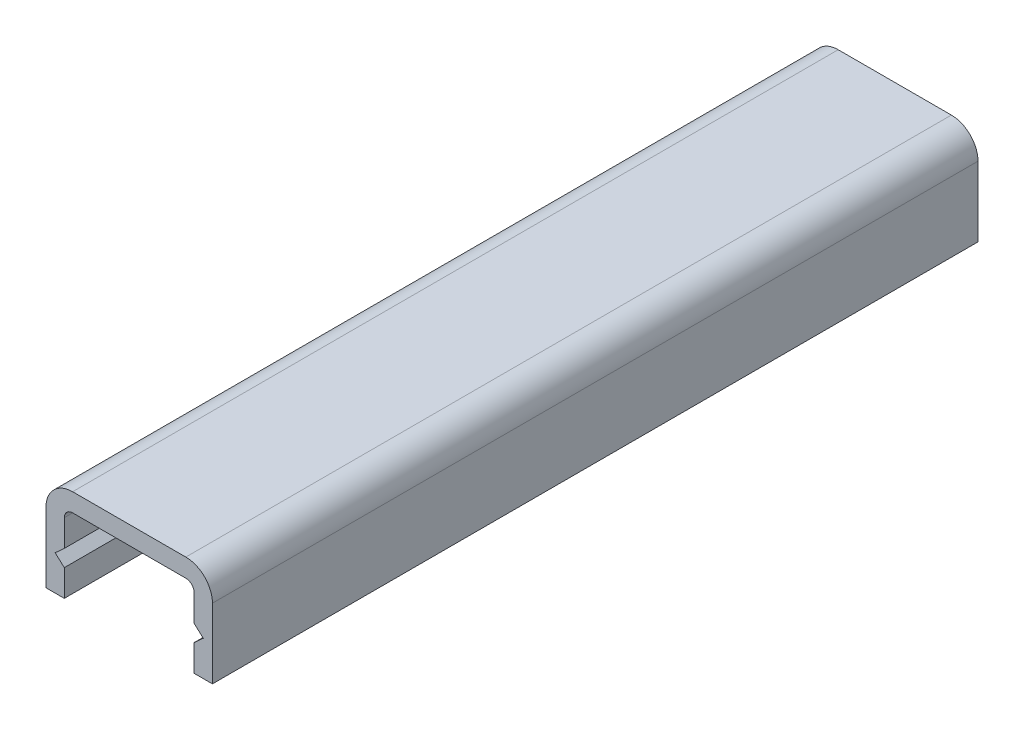
ISO-10303-21;
HEADER;
FILE_DESCRIPTION(('STEP AP214'),'2;1');
FILE_NAME('part.step','',(''),(''),'','','');
FILE_SCHEMA(('AUTOMOTIVE_DESIGN { 1 0 10303 214 1 1 1 1 }'));
ENDSEC;
DATA;
#1=APPLICATION_CONTEXT('core data for automotive mechanical design processes');
#2=APPLICATION_PROTOCOL_DEFINITION('international standard','automotive_design',2000,#1);
#3=PRODUCT_CONTEXT('',#1,'mechanical');
#4=PRODUCT('Part','Part','',(#3));
#5=PRODUCT_RELATED_PRODUCT_CATEGORY('part','',(#4));
#6=PRODUCT_DEFINITION_FORMATION('','',#4);
#7=PRODUCT_DEFINITION_CONTEXT('part definition',#1,'design');
#8=PRODUCT_DEFINITION('design','',#6,#7);
#9=PRODUCT_DEFINITION_SHAPE('','',#8);
#10=(LENGTH_UNIT() NAMED_UNIT(*) SI_UNIT(.MILLI.,.METRE.));
#11=(NAMED_UNIT(*) PLANE_ANGLE_UNIT() SI_UNIT($,.RADIAN.));
#12=(NAMED_UNIT(*) SI_UNIT($,.STERADIAN.) SOLID_ANGLE_UNIT());
#13=UNCERTAINTY_MEASURE_WITH_UNIT(LENGTH_MEASURE(1.E-05),#10,'distance_accuracy_value','');
#14=(GEOMETRIC_REPRESENTATION_CONTEXT(3) GLOBAL_UNCERTAINTY_ASSIGNED_CONTEXT((#13)) GLOBAL_UNIT_ASSIGNED_CONTEXT((#10,
#11,#12)) REPRESENTATION_CONTEXT('',''));
#15=CARTESIAN_POINT('',(0.,0.,0.));
#16=DIRECTION('',(0.,0.,1.));
#17=DIRECTION('',(1.,0.,0.));
#18=AXIS2_PLACEMENT_3D('',#15,#16,#17);
#19=CARTESIAN_POINT('',(0.,0.,46.));
#20=DIRECTION('',(0.,1.,0.));
#21=DIRECTION('',(0.,0.,1.));
#22=AXIS2_PLACEMENT_3D('',#19,#20,#21);
#23=PLANE('',#22);
#24=DIRECTION('',(1.,0.,0.));
#25=VECTOR('',#24,1.);
#26=CARTESIAN_POINT('',(0.,0.,0.));
#27=LINE('',#26,#25);
#28=CARTESIAN_POINT('',(0.,0.,0.));
#29=VERTEX_POINT('',#28);
#30=CARTESIAN_POINT('',(1.1,0.,0.));
#31=VERTEX_POINT('',#30);
#32=EDGE_CURVE('E189',#29,#31,#27,.T.);
#33=ORIENTED_EDGE('',*,*,#32,.T.);
#34=DIRECTION('',(0.,0.,-1.));
#35=VECTOR('',#34,1.);
#36=CARTESIAN_POINT('',(1.1,0.,46.));
#37=LINE('',#36,#35);
#38=CARTESIAN_POINT('',(1.1,0.,46.));
#39=VERTEX_POINT('',#38);
#40=EDGE_CURVE('E11',#39,#31,#37,.T.);
#41=ORIENTED_EDGE('',*,*,#40,.F.);
#42=DIRECTION('',(1.,0.,0.));
#43=VECTOR('',#42,1.);
#44=CARTESIAN_POINT('',(0.,0.,46.));
#45=LINE('',#44,#43);
#46=CARTESIAN_POINT('',(0.,0.,46.));
#47=VERTEX_POINT('',#46);
#48=EDGE_CURVE('E223',#47,#39,#45,.T.);
#49=ORIENTED_EDGE('',*,*,#48,.F.);
#50=DIRECTION('',(0.,0.,-1.));
#51=VECTOR('',#50,1.);
#52=CARTESIAN_POINT('',(0.,0.,46.));
#53=LINE('',#52,#51);
#54=EDGE_CURVE('E185',#47,#29,#53,.T.);
#55=ORIENTED_EDGE('',*,*,#54,.T.);
#56=EDGE_LOOP('',(#33,#41,#49,#55));
#57=FACE_BOUND('',#56,.T.);
#58=ADVANCED_FACE('F33',(#57),#23,.F.);
#59=CARTESIAN_POINT('',(1.1,1.6,46.));
#60=DIRECTION('',(-1.,0.,0.));
#61=DIRECTION('',(0.,0.,1.));
#62=AXIS2_PLACEMENT_3D('',#59,#60,#61);
#63=PLANE('',#62);
#64=DIRECTION('',(0.,1.,0.));
#65=VECTOR('',#64,1.);
#66=CARTESIAN_POINT('',(1.1,1.6,0.));
#67=LINE('',#66,#65);
#68=CARTESIAN_POINT('',(1.1,1.6,0.));
#69=VERTEX_POINT('',#68);
#70=EDGE_CURVE('E192',#31,#69,#67,.T.);
#71=ORIENTED_EDGE('',*,*,#70,.T.);
#72=DIRECTION('',(0.,0.,-1.));
#73=VECTOR('',#72,1.);
#74=CARTESIAN_POINT('',(1.1,1.6,46.));
#75=LINE('',#74,#73);
#76=CARTESIAN_POINT('',(1.1,1.6,46.));
#77=VERTEX_POINT('',#76);
#78=EDGE_CURVE('E41',#77,#69,#75,.T.);
#79=ORIENTED_EDGE('',*,*,#78,.F.);
#80=DIRECTION('',(0.,1.,0.));
#81=VECTOR('',#80,1.);
#82=CARTESIAN_POINT('',(1.1,1.6,46.));
#83=LINE('',#82,#81);
#84=EDGE_CURVE('E122',#39,#77,#83,.T.);
#85=ORIENTED_EDGE('',*,*,#84,.F.);
#86=ORIENTED_EDGE('',*,*,#40,.T.);
#87=EDGE_LOOP('',(#71,#79,#85,#86));
#88=FACE_BOUND('',#87,.T.);
#89=ADVANCED_FACE('F331',(#88),#63,.F.);
#90=CARTESIAN_POINT('',(1.1,1.6,46.));
#91=DIRECTION('',(-0.672672793996314,-0.739940073395942,0.));
#92=DIRECTION('',(0.739940073395943,-0.672672793996314,0.));
#93=AXIS2_PLACEMENT_3D('',#90,#91,#92);
#94=PLANE('',#93);
#95=DIRECTION('',(-0.739940073395943,0.672672793996314,0.));
#96=VECTOR('',#95,1.);
#97=CARTESIAN_POINT('',(1.1,1.6,0.));
#98=LINE('',#97,#96);
#99=CARTESIAN_POINT('',(0.55,2.1,0.));
#100=VERTEX_POINT('',#99);
#101=EDGE_CURVE('E194',#69,#100,#98,.T.);
#102=ORIENTED_EDGE('',*,*,#101,.T.);
#103=DIRECTION('',(0.,0.,-1.));
#104=VECTOR('',#103,1.);
#105=CARTESIAN_POINT('',(0.55,2.1,46.));
#106=LINE('',#105,#104);
#107=CARTESIAN_POINT('',(0.55,2.1,46.));
#108=VERTEX_POINT('',#107);
#109=EDGE_CURVE('E260',#108,#100,#106,.T.);
#110=ORIENTED_EDGE('',*,*,#109,.F.);
#111=DIRECTION('',(-0.739940073395943,0.672672793996314,0.));
#112=VECTOR('',#111,1.);
#113=CARTESIAN_POINT('',(1.1,1.6,46.));
#114=LINE('',#113,#112);
#115=EDGE_CURVE('E268',#77,#108,#114,.T.);
#116=ORIENTED_EDGE('',*,*,#115,.F.);
#117=ORIENTED_EDGE('',*,*,#78,.T.);
#118=EDGE_LOOP('',(#102,#110,#116,#117));
#119=FACE_BOUND('',#118,.T.);
#120=ADVANCED_FACE('F266',(#119),#94,.F.);
#121=CARTESIAN_POINT('',(1.1,2.6,46.));
#122=DIRECTION('',(-0.672672793996311,0.739940073395945,0.));
#123=DIRECTION('',(-0.739940073395945,-0.672672793996311,0.));
#124=AXIS2_PLACEMENT_3D('',#121,#122,#123);
#125=PLANE('',#124);
#126=DIRECTION('',(0.739940073395945,0.672672793996311,0.));
#127=VECTOR('',#126,1.);
#128=CARTESIAN_POINT('',(1.1,2.6,0.));
#129=LINE('',#128,#127);
#130=CARTESIAN_POINT('',(1.1,2.6,0.));
#131=VERTEX_POINT('',#130);
#132=EDGE_CURVE('E196',#100,#131,#129,.T.);
#133=ORIENTED_EDGE('',*,*,#132,.T.);
#134=DIRECTION('',(0.,0.,-1.));
#135=VECTOR('',#134,1.);
#136=CARTESIAN_POINT('',(1.1,2.6,46.));
#137=LINE('',#136,#135);
#138=CARTESIAN_POINT('',(1.1,2.6,46.));
#139=VERTEX_POINT('',#138);
#140=EDGE_CURVE('E257',#139,#131,#137,.T.);
#141=ORIENTED_EDGE('',*,*,#140,.F.);
#142=DIRECTION('',(0.739940073395945,0.672672793996311,0.));
#143=VECTOR('',#142,1.);
#144=CARTESIAN_POINT('',(1.1,2.6,46.));
#145=LINE('',#144,#143);
#146=EDGE_CURVE('E286',#108,#139,#145,.T.);
#147=ORIENTED_EDGE('',*,*,#146,.F.);
#148=ORIENTED_EDGE('',*,*,#109,.T.);
#149=EDGE_LOOP('',(#133,#141,#147,#148));
#150=FACE_BOUND('',#149,.T.);
#151=ADVANCED_FACE('F277',(#150),#125,.F.);
#152=CARTESIAN_POINT('',(1.1,4.2,46.));
#153=DIRECTION('',(-1.,0.,0.));
#154=DIRECTION('',(0.,-1.,0.));
#155=AXIS2_PLACEMENT_3D('',#152,#153,#154);
#156=PLANE('',#155);
#157=DIRECTION('',(0.,1.,0.));
#158=VECTOR('',#157,1.);
#159=CARTESIAN_POINT('',(1.1,4.2,0.));
#160=LINE('',#159,#158);
#161=CARTESIAN_POINT('',(1.1,4.2,0.));
#162=VERTEX_POINT('',#161);
#163=EDGE_CURVE('E198',#131,#162,#160,.T.);
#164=ORIENTED_EDGE('',*,*,#163,.T.);
#165=DIRECTION('',(0.,0.,-1.));
#166=VECTOR('',#165,1.);
#167=CARTESIAN_POINT('',(1.1,4.2,46.));
#168=LINE('',#167,#166);
#169=CARTESIAN_POINT('',(1.1,4.2,46.));
#170=VERTEX_POINT('',#169);
#171=EDGE_CURVE('E254',#170,#162,#168,.T.);
#172=ORIENTED_EDGE('',*,*,#171,.F.);
#173=DIRECTION('',(0.,1.,0.));
#174=VECTOR('',#173,1.);
#175=CARTESIAN_POINT('',(1.1,4.2,46.));
#176=LINE('',#175,#174);
#177=EDGE_CURVE('E283',#139,#170,#176,.T.);
#178=ORIENTED_EDGE('',*,*,#177,.F.);
#179=ORIENTED_EDGE('',*,*,#140,.T.);
#180=EDGE_LOOP('',(#164,#172,#178,#179));
#181=FACE_BOUND('',#180,.T.);
#182=ADVANCED_FACE('F281',(#181),#156,.F.);
#183=CARTESIAN_POINT('',(1.59999999999999,4.2,46.));
#184=DIRECTION('',(0.,0.,-1.));
#185=DIRECTION('',(-1.,0.,0.));
#186=AXIS2_PLACEMENT_3D('',#183,#184,#185);
#187=CYLINDRICAL_SURFACE('',#186,0.499999999999992);
#188=CARTESIAN_POINT('',(1.59999999999999,4.2,0.));
#189=DIRECTION('',(0.,0.,-1.));
#190=DIRECTION('',(1.,0.,0.));
#191=AXIS2_PLACEMENT_3D('',#188,#189,#190);
#192=CIRCLE('',#191,0.499999999999992);
#193=CARTESIAN_POINT('',(1.59999999999999,4.69999999999999,0.));
#194=VERTEX_POINT('',#193);
#195=EDGE_CURVE('E200',#162,#194,#192,.T.);
#196=ORIENTED_EDGE('',*,*,#195,.T.);
#197=DIRECTION('',(0.,0.,-1.));
#198=VECTOR('',#197,1.);
#199=CARTESIAN_POINT('',(1.59999999999999,4.69999999999999,46.));
#200=LINE('',#199,#198);
#201=CARTESIAN_POINT('',(1.59999999999999,4.69999999999999,46.));
#202=VERTEX_POINT('',#201);
#203=EDGE_CURVE('E251',#202,#194,#200,.T.);
#204=ORIENTED_EDGE('',*,*,#203,.F.);
#205=CARTESIAN_POINT('',(1.59999999999999,4.2,46.));
#206=DIRECTION('',(0.,0.,-1.));
#207=DIRECTION('',(1.,0.,0.));
#208=AXIS2_PLACEMENT_3D('',#205,#206,#207);
#209=CIRCLE('',#208,0.499999999999992);
#210=EDGE_CURVE('E285',#170,#202,#209,.T.);
#211=ORIENTED_EDGE('',*,*,#210,.F.);
#212=ORIENTED_EDGE('',*,*,#171,.T.);
#213=EDGE_LOOP('',(#196,#204,#211,#212));
#214=FACE_BOUND('',#213,.T.);
#215=ADVANCED_FACE('F344',(#214),#187,.F.);
#216=CARTESIAN_POINT('',(1.59999999999999,4.69999999999999,46.));
#217=DIRECTION('',(0.,1.,0.));
#218=DIRECTION('',(0.,0.,1.));
#219=AXIS2_PLACEMENT_3D('',#216,#217,#218);
#220=PLANE('',#219);
#221=DIRECTION('',(1.,0.,0.));
#222=VECTOR('',#221,1.);
#223=CARTESIAN_POINT('',(1.59999999999999,4.69999999999999,0.));
#224=LINE('',#223,#222);
#225=CARTESIAN_POINT('',(8.39999999999998,4.69999999999999,0.));
#226=VERTEX_POINT('',#225);
#227=EDGE_CURVE('E202',#194,#226,#224,.T.);
#228=ORIENTED_EDGE('',*,*,#227,.T.);
#229=DIRECTION('',(0.,0.,-1.));
#230=VECTOR('',#229,1.);
#231=CARTESIAN_POINT('',(8.39999999999998,4.69999999999999,46.));
#232=LINE('',#231,#230);
#233=CARTESIAN_POINT('',(8.39999999999998,4.69999999999999,46.));
#234=VERTEX_POINT('',#233);
#235=EDGE_CURVE('E248',#234,#226,#232,.T.);
#236=ORIENTED_EDGE('',*,*,#235,.F.);
#237=DIRECTION('',(1.,0.,0.));
#238=VECTOR('',#237,1.);
#239=CARTESIAN_POINT('',(1.59999999999999,4.69999999999999,46.));
#240=LINE('',#239,#238);
#241=EDGE_CURVE('E288',#202,#234,#240,.T.);
#242=ORIENTED_EDGE('',*,*,#241,.F.);
#243=ORIENTED_EDGE('',*,*,#203,.T.);
#244=EDGE_LOOP('',(#228,#236,#242,#243));
#245=FACE_BOUND('',#244,.T.);
#246=ADVANCED_FACE('F347',(#245),#220,.F.);
#247=CARTESIAN_POINT('',(8.39999999999998,4.2,46.));
#248=DIRECTION('',(0.,0.,-1.));
#249=DIRECTION('',(-1.,0.,0.));
#250=AXIS2_PLACEMENT_3D('',#247,#248,#249);
#251=CYLINDRICAL_SURFACE('',#250,0.499999999999991);
#252=CARTESIAN_POINT('',(8.39999999999998,4.2,0.));
#253=DIRECTION('',(0.,0.,-1.));
#254=DIRECTION('',(1.,0.,0.));
#255=AXIS2_PLACEMENT_3D('',#252,#253,#254);
#256=CIRCLE('',#255,0.499999999999991);
#257=CARTESIAN_POINT('',(8.89999999999997,4.2,0.));
#258=VERTEX_POINT('',#257);
#259=EDGE_CURVE('E204',#226,#258,#256,.T.);
#260=ORIENTED_EDGE('',*,*,#259,.T.);
#261=DIRECTION('',(0.,0.,-1.));
#262=VECTOR('',#261,1.);
#263=CARTESIAN_POINT('',(8.89999999999997,4.2,46.));
#264=LINE('',#263,#262);
#265=CARTESIAN_POINT('',(8.89999999999997,4.2,46.));
#266=VERTEX_POINT('',#265);
#267=EDGE_CURVE('E245',#266,#258,#264,.T.);
#268=ORIENTED_EDGE('',*,*,#267,.F.);
#269=CARTESIAN_POINT('',(8.39999999999998,4.2,46.));
#270=DIRECTION('',(0.,0.,-1.));
#271=DIRECTION('',(1.,0.,0.));
#272=AXIS2_PLACEMENT_3D('',#269,#270,#271);
#273=CIRCLE('',#272,0.499999999999991);
#274=EDGE_CURVE('E294',#234,#266,#273,.T.);
#275=ORIENTED_EDGE('',*,*,#274,.F.);
#276=ORIENTED_EDGE('',*,*,#235,.T.);
#277=EDGE_LOOP('',(#260,#268,#275,#276));
#278=FACE_BOUND('',#277,.T.);
#279=ADVANCED_FACE('F351',(#278),#251,.F.);
#280=CARTESIAN_POINT('',(8.89999999999997,4.2,46.));
#281=DIRECTION('',(1.,0.,0.));
#282=DIRECTION('',(0.,1.,0.));
#283=AXIS2_PLACEMENT_3D('',#280,#281,#282);
#284=PLANE('',#283);
#285=DIRECTION('',(0.,-1.,0.));
#286=VECTOR('',#285,1.);
#287=CARTESIAN_POINT('',(8.89999999999997,4.2,0.));
#288=LINE('',#287,#286);
#289=CARTESIAN_POINT('',(8.89999999999998,2.6,0.));
#290=VERTEX_POINT('',#289);
#291=EDGE_CURVE('E206',#258,#290,#288,.T.);
#292=ORIENTED_EDGE('',*,*,#291,.T.);
#293=DIRECTION('',(0.,0.,-1.));
#294=VECTOR('',#293,1.);
#295=CARTESIAN_POINT('',(8.89999999999998,2.6,46.));
#296=LINE('',#295,#294);
#297=CARTESIAN_POINT('',(8.89999999999998,2.6,46.));
#298=VERTEX_POINT('',#297);
#299=EDGE_CURVE('E242',#298,#290,#296,.T.);
#300=ORIENTED_EDGE('',*,*,#299,.F.);
#301=DIRECTION('',(0.,-1.,0.));
#302=VECTOR('',#301,1.);
#303=CARTESIAN_POINT('',(8.89999999999997,4.2,46.));
#304=LINE('',#303,#302);
#305=EDGE_CURVE('E296',#266,#298,#304,.T.);
#306=ORIENTED_EDGE('',*,*,#305,.F.);
#307=ORIENTED_EDGE('',*,*,#267,.T.);
#308=EDGE_LOOP('',(#292,#300,#306,#307));
#309=FACE_BOUND('',#308,.T.);
#310=ADVANCED_FACE('F355',(#309),#284,.F.);
#311=CARTESIAN_POINT('',(8.89999999999998,2.6,46.));
#312=DIRECTION('',(0.672672793996294,0.739940073395961,0.));
#313=DIRECTION('',(-0.739940073395961,0.672672793996294,0.));
#314=AXIS2_PLACEMENT_3D('',#311,#312,#313);
#315=PLANE('',#314);
#316=DIRECTION('',(0.739940073395961,-0.672672793996294,0.));
#317=VECTOR('',#316,1.);
#318=CARTESIAN_POINT('',(8.89999999999998,2.6,0.));
#319=LINE('',#318,#317);
#320=CARTESIAN_POINT('',(9.45,2.1,0.));
#321=VERTEX_POINT('',#320);
#322=EDGE_CURVE('E208',#290,#321,#319,.T.);
#323=ORIENTED_EDGE('',*,*,#322,.T.);
#324=DIRECTION('',(0.,0.,-1.));
#325=VECTOR('',#324,1.);
#326=CARTESIAN_POINT('',(9.45,2.1,46.));
#327=LINE('',#326,#325);
#328=CARTESIAN_POINT('',(9.45,2.1,46.));
#329=VERTEX_POINT('',#328);
#330=EDGE_CURVE('E239',#329,#321,#327,.T.);
#331=ORIENTED_EDGE('',*,*,#330,.F.);
#332=DIRECTION('',(0.739940073395961,-0.672672793996294,0.));
#333=VECTOR('',#332,1.);
#334=CARTESIAN_POINT('',(8.89999999999998,2.6,46.));
#335=LINE('',#334,#333);
#336=EDGE_CURVE('E298',#298,#329,#335,.T.);
#337=ORIENTED_EDGE('',*,*,#336,.F.);
#338=ORIENTED_EDGE('',*,*,#299,.T.);
#339=EDGE_LOOP('',(#323,#331,#337,#338));
#340=FACE_BOUND('',#339,.T.);
#341=ADVANCED_FACE('F359',(#340),#315,.F.);
#342=CARTESIAN_POINT('',(8.89999999999998,1.6,46.));
#343=DIRECTION('',(0.672672793996296,-0.739940073395959,0.));
#344=DIRECTION('',(0.739940073395959,0.672672793996296,0.));
#345=AXIS2_PLACEMENT_3D('',#342,#343,#344);
#346=PLANE('',#345);
#347=DIRECTION('',(-0.739940073395959,-0.672672793996296,0.));
#348=VECTOR('',#347,1.);
#349=CARTESIAN_POINT('',(8.89999999999998,1.6,0.));
#350=LINE('',#349,#348);
#351=CARTESIAN_POINT('',(8.89999999999998,1.6,0.));
#352=VERTEX_POINT('',#351);
#353=EDGE_CURVE('E210',#321,#352,#350,.T.);
#354=ORIENTED_EDGE('',*,*,#353,.T.);
#355=DIRECTION('',(0.,0.,-1.));
#356=VECTOR('',#355,1.);
#357=CARTESIAN_POINT('',(8.89999999999998,1.6,46.));
#358=LINE('',#357,#356);
#359=CARTESIAN_POINT('',(8.89999999999998,1.6,46.));
#360=VERTEX_POINT('',#359);
#361=EDGE_CURVE('E236',#360,#352,#358,.T.);
#362=ORIENTED_EDGE('',*,*,#361,.F.);
#363=DIRECTION('',(-0.739940073395959,-0.672672793996296,0.));
#364=VECTOR('',#363,1.);
#365=CARTESIAN_POINT('',(8.89999999999998,1.6,46.));
#366=LINE('',#365,#364);
#367=EDGE_CURVE('E300',#329,#360,#366,.T.);
#368=ORIENTED_EDGE('',*,*,#367,.F.);
#369=ORIENTED_EDGE('',*,*,#330,.T.);
#370=EDGE_LOOP('',(#354,#362,#368,#369));
#371=FACE_BOUND('',#370,.T.);
#372=ADVANCED_FACE('F363',(#371),#346,.F.);
#373=CARTESIAN_POINT('',(8.89999999999998,1.6,46.));
#374=DIRECTION('',(1.,0.,0.));
#375=DIRECTION('',(0.,0.,-1.));
#376=AXIS2_PLACEMENT_3D('',#373,#374,#375);
#377=PLANE('',#376);
#378=DIRECTION('',(0.,-1.,0.));
#379=VECTOR('',#378,1.);
#380=CARTESIAN_POINT('',(8.89999999999998,1.6,0.));
#381=LINE('',#380,#379);
#382=CARTESIAN_POINT('',(8.89999999999998,0.,0.));
#383=VERTEX_POINT('',#382);
#384=EDGE_CURVE('E212',#352,#383,#381,.T.);
#385=ORIENTED_EDGE('',*,*,#384,.T.);
#386=DIRECTION('',(0.,0.,-1.));
#387=VECTOR('',#386,1.);
#388=CARTESIAN_POINT('',(8.89999999999998,0.,46.));
#389=LINE('',#388,#387);
#390=CARTESIAN_POINT('',(8.89999999999998,0.,46.));
#391=VERTEX_POINT('',#390);
#392=EDGE_CURVE('E233',#391,#383,#389,.T.);
#393=ORIENTED_EDGE('',*,*,#392,.F.);
#394=DIRECTION('',(0.,-1.,0.));
#395=VECTOR('',#394,1.);
#396=CARTESIAN_POINT('',(8.89999999999998,1.6,46.));
#397=LINE('',#396,#395);
#398=EDGE_CURVE('E302',#360,#391,#397,.T.);
#399=ORIENTED_EDGE('',*,*,#398,.F.);
#400=ORIENTED_EDGE('',*,*,#361,.T.);
#401=EDGE_LOOP('',(#385,#393,#399,#400));
#402=FACE_BOUND('',#401,.T.);
#403=ADVANCED_FACE('F367',(#402),#377,.F.);
#404=CARTESIAN_POINT('',(9.99999999999998,0.,46.));
#405=DIRECTION('',(0.,1.,0.));
#406=DIRECTION('',(0.,0.,1.));
#407=AXIS2_PLACEMENT_3D('',#404,#405,#406);
#408=PLANE('',#407);
#409=DIRECTION('',(1.,0.,0.));
#410=VECTOR('',#409,1.);
#411=CARTESIAN_POINT('',(9.99999999999998,0.,0.));
#412=LINE('',#411,#410);
#413=CARTESIAN_POINT('',(9.99999999999998,0.,0.));
#414=VERTEX_POINT('',#413);
#415=EDGE_CURVE('E214',#383,#414,#412,.T.);
#416=ORIENTED_EDGE('',*,*,#415,.T.);
#417=DIRECTION('',(0.,0.,-1.));
#418=VECTOR('',#417,1.);
#419=CARTESIAN_POINT('',(9.99999999999998,0.,46.));
#420=LINE('',#419,#418);
#421=CARTESIAN_POINT('',(9.99999999999998,0.,46.));
#422=VERTEX_POINT('',#421);
#423=EDGE_CURVE('E230',#422,#414,#420,.T.);
#424=ORIENTED_EDGE('',*,*,#423,.F.);
#425=DIRECTION('',(1.,0.,0.));
#426=VECTOR('',#425,1.);
#427=CARTESIAN_POINT('',(9.99999999999998,0.,46.));
#428=LINE('',#427,#426);
#429=EDGE_CURVE('E304',#391,#422,#428,.T.);
#430=ORIENTED_EDGE('',*,*,#429,.F.);
#431=ORIENTED_EDGE('',*,*,#392,.T.);
#432=EDGE_LOOP('',(#416,#424,#430,#431));
#433=FACE_BOUND('',#432,.T.);
#434=ADVANCED_FACE('F371',(#433),#408,.F.);
#435=CARTESIAN_POINT('',(9.99999999999998,4.19999999999999,46.));
#436=DIRECTION('',(-1.,0.,0.));
#437=DIRECTION('',(0.,0.,1.));
#438=AXIS2_PLACEMENT_3D('',#435,#436,#437);
#439=PLANE('',#438);
#440=DIRECTION('',(0.,1.,0.));
#441=VECTOR('',#440,1.);
#442=CARTESIAN_POINT('',(9.99999999999998,4.19999999999999,0.));
#443=LINE('',#442,#441);
#444=CARTESIAN_POINT('',(9.99999999999998,4.19999999999999,0.));
#445=VERTEX_POINT('',#444);
#446=EDGE_CURVE('E216',#414,#445,#443,.T.);
#447=ORIENTED_EDGE('',*,*,#446,.T.);
#448=DIRECTION('',(0.,0.,-1.));
#449=VECTOR('',#448,1.);
#450=CARTESIAN_POINT('',(9.99999999999998,4.19999999999999,46.));
#451=LINE('',#450,#449);
#452=CARTESIAN_POINT('',(9.99999999999998,4.19999999999999,46.));
#453=VERTEX_POINT('',#452);
#454=EDGE_CURVE('E227',#453,#445,#451,.T.);
#455=ORIENTED_EDGE('',*,*,#454,.F.);
#456=DIRECTION('',(0.,1.,0.));
#457=VECTOR('',#456,1.);
#458=CARTESIAN_POINT('',(9.99999999999998,4.19999999999999,46.));
#459=LINE('',#458,#457);
#460=EDGE_CURVE('E306',#422,#453,#459,.T.);
#461=ORIENTED_EDGE('',*,*,#460,.F.);
#462=ORIENTED_EDGE('',*,*,#423,.T.);
#463=EDGE_LOOP('',(#447,#455,#461,#462));
#464=FACE_BOUND('',#463,.T.);
#465=ADVANCED_FACE('F312',(#464),#439,.F.);
#466=CARTESIAN_POINT('',(8.39999999999998,4.19999999999999,46.));
#467=DIRECTION('',(0.,0.,-1.));
#468=DIRECTION('',(-1.,0.,0.));
#469=AXIS2_PLACEMENT_3D('',#466,#467,#468);
#470=CYLINDRICAL_SURFACE('',#469,1.6);
#471=CARTESIAN_POINT('',(8.39999999999998,4.19999999999999,0.));
#472=DIRECTION('',(0.,0.,1.));
#473=DIRECTION('',(-1.,0.,0.));
#474=AXIS2_PLACEMENT_3D('',#471,#472,#473);
#475=CIRCLE('',#474,1.6);
#476=CARTESIAN_POINT('',(8.39999999999998,5.79999999999999,0.));
#477=VERTEX_POINT('',#476);
#478=EDGE_CURVE('E218',#445,#477,#475,.T.);
#479=ORIENTED_EDGE('',*,*,#478,.T.);
#480=DIRECTION('',(0.,0.,-1.));
#481=VECTOR('',#480,1.);
#482=CARTESIAN_POINT('',(8.39999999999998,5.79999999999999,46.));
#483=LINE('',#482,#481);
#484=CARTESIAN_POINT('',(8.39999999999998,5.79999999999999,46.));
#485=VERTEX_POINT('',#484);
#486=EDGE_CURVE('E180',#485,#477,#483,.T.);
#487=ORIENTED_EDGE('',*,*,#486,.F.);
#488=CARTESIAN_POINT('',(8.39999999999998,4.19999999999999,46.));
#489=DIRECTION('',(0.,0.,1.));
#490=DIRECTION('',(-1.,0.,0.));
#491=AXIS2_PLACEMENT_3D('',#488,#489,#490);
#492=CIRCLE('',#491,1.6);
#493=EDGE_CURVE('E171',#453,#485,#492,.T.);
#494=ORIENTED_EDGE('',*,*,#493,.F.);
#495=ORIENTED_EDGE('',*,*,#454,.T.);
#496=EDGE_LOOP('',(#479,#487,#494,#495));
#497=FACE_BOUND('',#496,.T.);
#498=ADVANCED_FACE('F316',(#497),#470,.T.);
#499=CARTESIAN_POINT('',(1.6,5.79999999999999,46.));
#500=DIRECTION('',(0.,-1.,0.));
#501=DIRECTION('',(0.,0.,-1.));
#502=AXIS2_PLACEMENT_3D('',#499,#500,#501);
#503=PLANE('',#502);
#504=DIRECTION('',(-1.,0.,0.));
#505=VECTOR('',#504,1.);
#506=CARTESIAN_POINT('',(1.6,5.79999999999999,0.));
#507=LINE('',#506,#505);
#508=CARTESIAN_POINT('',(1.6,5.79999999999999,0.));
#509=VERTEX_POINT('',#508);
#510=EDGE_CURVE('E179',#477,#509,#507,.T.);
#511=ORIENTED_EDGE('',*,*,#510,.T.);
#512=DIRECTION('',(0.,0.,-1.));
#513=VECTOR('',#512,1.);
#514=CARTESIAN_POINT('',(1.6,5.79999999999999,46.));
#515=LINE('',#514,#513);
#516=CARTESIAN_POINT('',(1.6,5.79999999999999,46.));
#517=VERTEX_POINT('',#516);
#518=EDGE_CURVE('E176',#517,#509,#515,.T.);
#519=ORIENTED_EDGE('',*,*,#518,.F.);
#520=DIRECTION('',(-1.,0.,0.));
#521=VECTOR('',#520,1.);
#522=CARTESIAN_POINT('',(1.6,5.79999999999999,46.));
#523=LINE('',#522,#521);
#524=EDGE_CURVE('E165',#485,#517,#523,.T.);
#525=ORIENTED_EDGE('',*,*,#524,.F.);
#526=ORIENTED_EDGE('',*,*,#486,.T.);
#527=EDGE_LOOP('',(#511,#519,#525,#526));
#528=FACE_BOUND('',#527,.T.);
#529=ADVANCED_FACE('F177',(#528),#503,.F.);
#530=CARTESIAN_POINT('',(1.6,4.19999999999999,46.));
#531=DIRECTION('',(0.,0.,-1.));
#532=DIRECTION('',(-1.,0.,0.));
#533=AXIS2_PLACEMENT_3D('',#530,#531,#532);
#534=CYLINDRICAL_SURFACE('',#533,1.6);
#535=CARTESIAN_POINT('',(1.6,4.19999999999999,0.));
#536=DIRECTION('',(0.,0.,1.));
#537=DIRECTION('',(-1.,0.,0.));
#538=AXIS2_PLACEMENT_3D('',#535,#536,#537);
#539=CIRCLE('',#538,1.6);
#540=CARTESIAN_POINT('',(0.,4.19999999999999,0.));
#541=VERTEX_POINT('',#540);
#542=EDGE_CURVE('E108',#509,#541,#539,.T.);
#543=ORIENTED_EDGE('',*,*,#542,.T.);
#544=DIRECTION('',(0.,0.,-1.));
#545=VECTOR('',#544,1.);
#546=CARTESIAN_POINT('',(0.,4.19999999999999,46.));
#547=LINE('',#546,#545);
#548=CARTESIAN_POINT('',(0.,4.19999999999999,46.));
#549=VERTEX_POINT('',#548);
#550=EDGE_CURVE('E181',#549,#541,#547,.T.);
#551=ORIENTED_EDGE('',*,*,#550,.F.);
#552=CARTESIAN_POINT('',(1.6,4.19999999999999,46.));
#553=DIRECTION('',(0.,0.,1.));
#554=DIRECTION('',(-1.,0.,0.));
#555=AXIS2_PLACEMENT_3D('',#552,#553,#554);
#556=CIRCLE('',#555,1.6);
#557=EDGE_CURVE('E169',#517,#549,#556,.T.);
#558=ORIENTED_EDGE('',*,*,#557,.F.);
#559=ORIENTED_EDGE('',*,*,#518,.T.);
#560=EDGE_LOOP('',(#543,#551,#558,#559));
#561=FACE_BOUND('',#560,.T.);
#562=ADVANCED_FACE('F183',(#561),#534,.T.);
#563=CARTESIAN_POINT('',(0.,4.19999999999999,46.));
#564=DIRECTION('',(1.,0.,0.));
#565=DIRECTION('',(0.,1.,0.));
#566=AXIS2_PLACEMENT_3D('',#563,#564,#565);
#567=PLANE('',#566);
#568=DIRECTION('',(0.,-1.,0.));
#569=VECTOR('',#568,1.);
#570=CARTESIAN_POINT('',(0.,4.19999999999999,0.));
#571=LINE('',#570,#569);
#572=EDGE_CURVE('E114',#541,#29,#571,.T.);
#573=ORIENTED_EDGE('',*,*,#572,.T.);
#574=ORIENTED_EDGE('',*,*,#54,.F.);
#575=DIRECTION('',(0.,-1.,0.));
#576=VECTOR('',#575,1.);
#577=CARTESIAN_POINT('',(0.,4.19999999999999,46.));
#578=LINE('',#577,#576);
#579=EDGE_CURVE('E49',#549,#47,#578,.T.);
#580=ORIENTED_EDGE('',*,*,#579,.F.);
#581=ORIENTED_EDGE('',*,*,#550,.T.);
#582=EDGE_LOOP('',(#573,#574,#580,#581));
#583=FACE_BOUND('',#582,.T.);
#584=ADVANCED_FACE('F320',(#583),#567,.F.);
#585=CARTESIAN_POINT('',(1.59999999999999,4.2,46.));
#586=DIRECTION('',(0.,0.,1.));
#587=DIRECTION('',(1.,0.,0.));
#588=AXIS2_PLACEMENT_3D('',#585,#586,#587);
#589=PLANE('',#588);
#590=ORIENTED_EDGE('',*,*,#48,.T.);
#591=ORIENTED_EDGE('',*,*,#84,.T.);
#592=ORIENTED_EDGE('',*,*,#115,.T.);
#593=ORIENTED_EDGE('',*,*,#146,.T.);
#594=ORIENTED_EDGE('',*,*,#177,.T.);
#595=ORIENTED_EDGE('',*,*,#210,.T.);
#596=ORIENTED_EDGE('',*,*,#241,.T.);
#597=ORIENTED_EDGE('',*,*,#274,.T.);
#598=ORIENTED_EDGE('',*,*,#305,.T.);
#599=ORIENTED_EDGE('',*,*,#336,.T.);
#600=ORIENTED_EDGE('',*,*,#367,.T.);
#601=ORIENTED_EDGE('',*,*,#398,.T.);
#602=ORIENTED_EDGE('',*,*,#429,.T.);
#603=ORIENTED_EDGE('',*,*,#460,.T.);
#604=ORIENTED_EDGE('',*,*,#493,.T.);
#605=ORIENTED_EDGE('',*,*,#524,.T.);
#606=ORIENTED_EDGE('',*,*,#557,.T.);
#607=ORIENTED_EDGE('',*,*,#579,.T.);
#608=EDGE_LOOP('',(#590,#591,#592,#593,#594,#595,#596,#597,#598,#599,#600,#601,#602,#603,#604,
#605,#606,#607));
#609=FACE_BOUND('',#608,.T.);
#610=ADVANCED_FACE('F167',(#609),#589,.T.);
#611=CARTESIAN_POINT('',(1.59999999999999,4.2,0.));
#612=DIRECTION('',(0.,0.,1.));
#613=DIRECTION('',(1.,0.,0.));
#614=AXIS2_PLACEMENT_3D('',#611,#612,#613);
#615=PLANE('',#614);
#616=ORIENTED_EDGE('',*,*,#32,.F.);
#617=ORIENTED_EDGE('',*,*,#572,.F.);
#618=ORIENTED_EDGE('',*,*,#542,.F.);
#619=ORIENTED_EDGE('',*,*,#510,.F.);
#620=ORIENTED_EDGE('',*,*,#478,.F.);
#621=ORIENTED_EDGE('',*,*,#446,.F.);
#622=ORIENTED_EDGE('',*,*,#415,.F.);
#623=ORIENTED_EDGE('',*,*,#384,.F.);
#624=ORIENTED_EDGE('',*,*,#353,.F.);
#625=ORIENTED_EDGE('',*,*,#322,.F.);
#626=ORIENTED_EDGE('',*,*,#291,.F.);
#627=ORIENTED_EDGE('',*,*,#259,.F.);
#628=ORIENTED_EDGE('',*,*,#227,.F.);
#629=ORIENTED_EDGE('',*,*,#195,.F.);
#630=ORIENTED_EDGE('',*,*,#163,.F.);
#631=ORIENTED_EDGE('',*,*,#132,.F.);
#632=ORIENTED_EDGE('',*,*,#101,.F.);
#633=ORIENTED_EDGE('',*,*,#70,.F.);
#634=EDGE_LOOP('',(#616,#617,#618,#619,#620,#621,#622,#623,#624,#625,#626,#627,#628,#629,#630,
#631,#632,#633));
#635=FACE_BOUND('',#634,.T.);
#636=ADVANCED_FACE('F272',(#635),#615,.F.);
#637=CLOSED_SHELL('',(#58,#89,#120,#151,#182,#215,#246,#279,#310,#341,#372,#403,#434,#465,#498,
#529,#562,#584,#610,#636));
#638=MANIFOLD_SOLID_BREP('B2',#637);
#639=ADVANCED_BREP_SHAPE_REPRESENTATION('',(#18,#638),#14);
#640=SHAPE_DEFINITION_REPRESENTATION(#9,#639);
ENDSEC;
END-ISO-10303-21;
